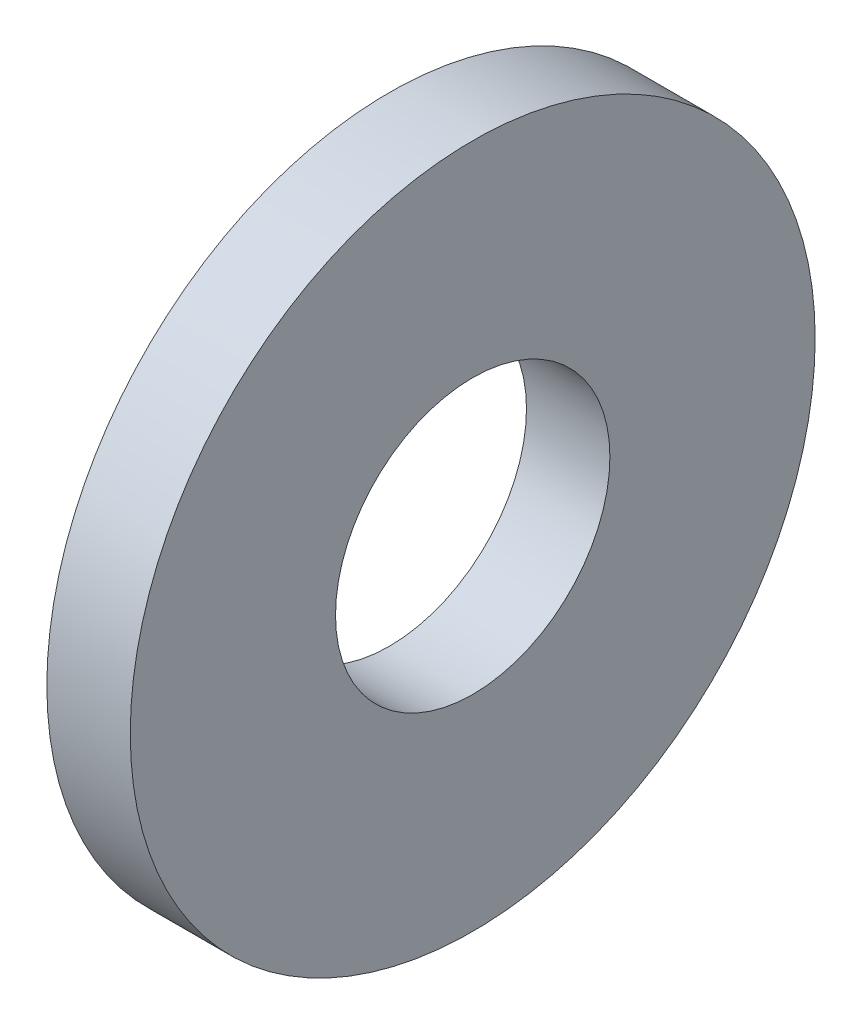
ISO-10303-21;
HEADER;
FILE_DESCRIPTION(('STEP AP214'),'2;1');
FILE_NAME('part.step','',(''),(''),'','','');
FILE_SCHEMA(('AUTOMOTIVE_DESIGN { 1 0 10303 214 1 1 1 1 }'));
ENDSEC;
DATA;
#1=APPLICATION_CONTEXT('core data for automotive mechanical design processes');
#2=APPLICATION_PROTOCOL_DEFINITION('international standard','automotive_design',2000,#1);
#3=PRODUCT_CONTEXT('',#1,'mechanical');
#4=PRODUCT('Part','Part','',(#3));
#5=PRODUCT_RELATED_PRODUCT_CATEGORY('part','',(#4));
#6=PRODUCT_DEFINITION_FORMATION('','',#4);
#7=PRODUCT_DEFINITION_CONTEXT('part definition',#1,'design');
#8=PRODUCT_DEFINITION('design','',#6,#7);
#9=PRODUCT_DEFINITION_SHAPE('','',#8);
#10=(LENGTH_UNIT() NAMED_UNIT(*) SI_UNIT(.MILLI.,.METRE.));
#11=(NAMED_UNIT(*) PLANE_ANGLE_UNIT() SI_UNIT($,.RADIAN.));
#12=(NAMED_UNIT(*) SI_UNIT($,.STERADIAN.) SOLID_ANGLE_UNIT());
#13=UNCERTAINTY_MEASURE_WITH_UNIT(LENGTH_MEASURE(1.E-05),#10,'distance_accuracy_value','');
#14=(GEOMETRIC_REPRESENTATION_CONTEXT(3) GLOBAL_UNCERTAINTY_ASSIGNED_CONTEXT((#13)) GLOBAL_UNIT_ASSIGNED_CONTEXT((#10,
#11,#12)) REPRESENTATION_CONTEXT('',''));
#15=CARTESIAN_POINT('',(0.,0.,0.));
#16=DIRECTION('',(0.,0.,1.));
#17=DIRECTION('',(1.,0.,0.));
#18=AXIS2_PLACEMENT_3D('',#15,#16,#17);
#19=CARTESIAN_POINT('',(0.9652,0.,0.));
#20=DIRECTION('',(1.,0.,0.));
#21=DIRECTION('',(0.,0.,-1.));
#22=AXIS2_PLACEMENT_3D('',#19,#20,#21);
#23=PLANE('',#22);
#24=CARTESIAN_POINT('',(0.9652,0.,0.));
#25=DIRECTION('',(1.,0.,0.));
#26=DIRECTION('',(0.,0.,-1.));
#27=AXIS2_PLACEMENT_3D('',#24,#25,#26);
#28=CIRCLE('',#27,3.9624);
#29=CARTESIAN_POINT('',(0.9652,0.,-3.9624));
#30=VERTEX_POINT('',#29);
#31=EDGE_CURVE('E10',#30,#30,#28,.T.);
#32=ORIENTED_EDGE('',*,*,#31,.T.);
#33=EDGE_LOOP('',(#32));
#34=FACE_BOUND('',#33,.T.);
#35=CARTESIAN_POINT('',(0.9652,0.,0.));
#36=DIRECTION('',(1.,0.,0.));
#37=DIRECTION('',(0.,0.,-1.));
#38=AXIS2_PLACEMENT_3D('',#35,#36,#37);
#39=CIRCLE('',#38,1.5875);
#40=CARTESIAN_POINT('',(0.9652,0.,-1.5875));
#41=VERTEX_POINT('',#40);
#42=EDGE_CURVE('E45',#41,#41,#39,.T.);
#43=ORIENTED_EDGE('',*,*,#42,.F.);
#44=EDGE_LOOP('',(#43));
#45=FACE_BOUND('',#44,.T.);
#46=ADVANCED_FACE('F34',(#34,#45),#23,.T.);
#47=CARTESIAN_POINT('',(0.,0.,0.));
#48=DIRECTION('',(1.,0.,0.));
#49=DIRECTION('',(0.,0.,-1.));
#50=AXIS2_PLACEMENT_3D('',#47,#48,#49);
#51=PLANE('',#50);
#52=CARTESIAN_POINT('',(0.,0.,0.));
#53=DIRECTION('',(1.,0.,0.));
#54=DIRECTION('',(0.,0.,-1.));
#55=AXIS2_PLACEMENT_3D('',#52,#53,#54);
#56=CIRCLE('',#55,3.9624);
#57=CARTESIAN_POINT('',(0.,0.,-3.9624));
#58=VERTEX_POINT('',#57);
#59=EDGE_CURVE('E38',#58,#58,#56,.T.);
#60=ORIENTED_EDGE('',*,*,#59,.F.);
#61=EDGE_LOOP('',(#60));
#62=FACE_BOUND('',#61,.T.);
#63=CARTESIAN_POINT('',(0.,0.,0.));
#64=DIRECTION('',(1.,0.,0.));
#65=DIRECTION('',(0.,0.,-1.));
#66=AXIS2_PLACEMENT_3D('',#63,#64,#65);
#67=CIRCLE('',#66,1.5875);
#68=CARTESIAN_POINT('',(0.,0.,-1.5875));
#69=VERTEX_POINT('',#68);
#70=EDGE_CURVE('E47',#69,#69,#67,.T.);
#71=ORIENTED_EDGE('',*,*,#70,.T.);
#72=EDGE_LOOP('',(#71));
#73=FACE_BOUND('',#72,.T.);
#74=ADVANCED_FACE('F57',(#62,#73),#51,.F.);
#75=CARTESIAN_POINT('',(0.9652,0.,0.));
#76=DIRECTION('',(-1.,0.,0.));
#77=DIRECTION('',(0.,0.,1.));
#78=AXIS2_PLACEMENT_3D('',#75,#76,#77);
#79=CYLINDRICAL_SURFACE('',#78,3.9624);
#80=ORIENTED_EDGE('',*,*,#31,.F.);
#81=EDGE_LOOP('',(#80));
#82=FACE_BOUND('',#81,.T.);
#83=ORIENTED_EDGE('',*,*,#59,.T.);
#84=EDGE_LOOP('',(#83));
#85=FACE_BOUND('',#84,.T.);
#86=ADVANCED_FACE('F36',(#82,#85),#79,.T.);
#87=CARTESIAN_POINT('',(0.9652,0.,0.));
#88=DIRECTION('',(-1.,0.,0.));
#89=DIRECTION('',(0.,0.,1.));
#90=AXIS2_PLACEMENT_3D('',#87,#88,#89);
#91=CYLINDRICAL_SURFACE('',#90,1.5875);
#92=ORIENTED_EDGE('',*,*,#42,.T.);
#93=EDGE_LOOP('',(#92));
#94=FACE_BOUND('',#93,.T.);
#95=ORIENTED_EDGE('',*,*,#70,.F.);
#96=EDGE_LOOP('',(#95));
#97=FACE_BOUND('',#96,.T.);
#98=ADVANCED_FACE('F53',(#94,#97),#91,.F.);
#99=CLOSED_SHELL('',(#46,#74,#86,#98));
#100=MANIFOLD_SOLID_BREP('B2',#99);
#101=ADVANCED_BREP_SHAPE_REPRESENTATION('',(#18,#100),#14);
#102=SHAPE_DEFINITION_REPRESENTATION(#9,#101);
ENDSEC;
END-ISO-10303-21;
